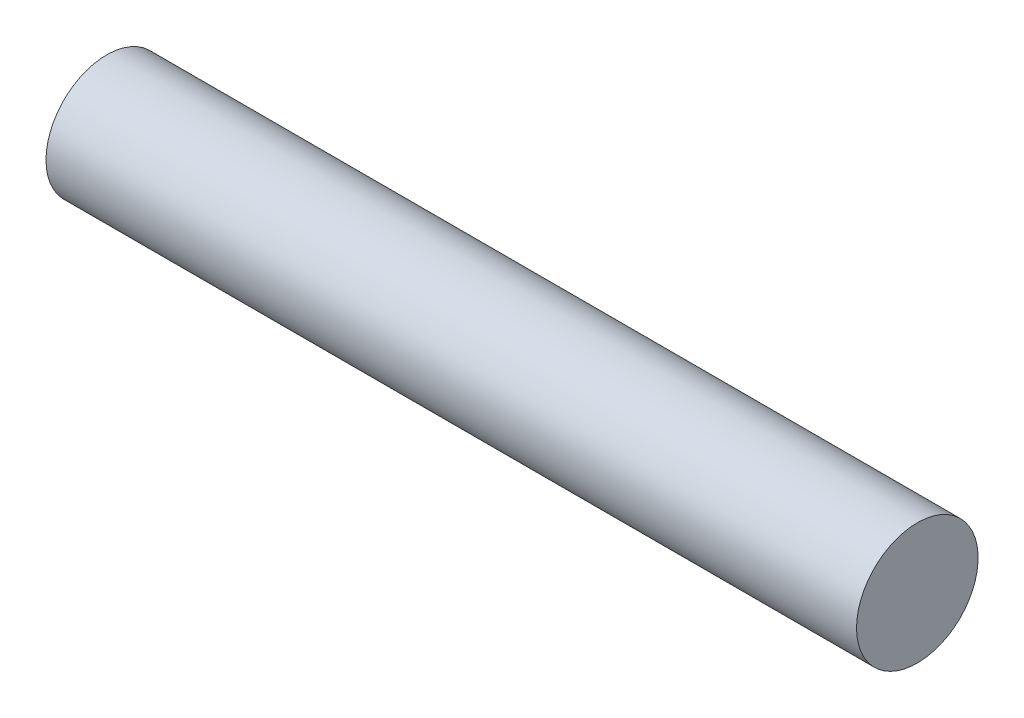
ISO-10303-21;
HEADER;
FILE_DESCRIPTION(('STEP AP214'),'2;1');
FILE_NAME('part.step','',(''),(''),'','','');
FILE_SCHEMA(('AUTOMOTIVE_DESIGN { 1 0 10303 214 1 1 1 1 }'));
ENDSEC;
DATA;
#1=APPLICATION_CONTEXT('core data for automotive mechanical design processes');
#2=APPLICATION_PROTOCOL_DEFINITION('international standard','automotive_design',2000,#1);
#3=PRODUCT_CONTEXT('',#1,'mechanical');
#4=PRODUCT('Part','Part','',(#3));
#5=PRODUCT_RELATED_PRODUCT_CATEGORY('part','',(#4));
#6=PRODUCT_DEFINITION_FORMATION('','',#4);
#7=PRODUCT_DEFINITION_CONTEXT('part definition',#1,'design');
#8=PRODUCT_DEFINITION('design','',#6,#7);
#9=PRODUCT_DEFINITION_SHAPE('','',#8);
#10=(LENGTH_UNIT() NAMED_UNIT(*) SI_UNIT(.MILLI.,.METRE.));
#11=(NAMED_UNIT(*) PLANE_ANGLE_UNIT() SI_UNIT($,.RADIAN.));
#12=(NAMED_UNIT(*) SI_UNIT($,.STERADIAN.) SOLID_ANGLE_UNIT());
#13=UNCERTAINTY_MEASURE_WITH_UNIT(LENGTH_MEASURE(1.E-05),#10,'distance_accuracy_value','');
#14=(GEOMETRIC_REPRESENTATION_CONTEXT(3) GLOBAL_UNCERTAINTY_ASSIGNED_CONTEXT((#13)) GLOBAL_UNIT_ASSIGNED_CONTEXT((#10,
#11,#12)) REPRESENTATION_CONTEXT('',''));
#15=CARTESIAN_POINT('',(0.,0.,0.));
#16=DIRECTION('',(0.,0.,1.));
#17=DIRECTION('',(1.,0.,0.));
#18=AXIS2_PLACEMENT_3D('',#15,#16,#17);
#19=CARTESIAN_POINT('',(651.894917120642,43.1757528863374,-362.871701067118));
#20=DIRECTION('',(-1.,0.,0.));
#21=DIRECTION('',(0.,0.,1.));
#22=AXIS2_PLACEMENT_3D('',#19,#20,#21);
#23=PLANE('',#22);
#24=CARTESIAN_POINT('',(651.894917120642,85.5761740117687,-295.009153101937));
#25=DIRECTION('',(-1.,0.,0.));
#26=DIRECTION('',(0.,0.,1.));
#27=AXIS2_PLACEMENT_3D('',#24,#25,#26);
#28=CIRCLE('',#27,1.5);
#29=CARTESIAN_POINT('',(651.894917120642,85.5761740117687,-293.509153101937));
#30=VERTEX_POINT('',#29);
#31=EDGE_CURVE('E18',#30,#30,#28,.F.);
#32=ORIENTED_EDGE('',*,*,#31,.F.);
#33=EDGE_LOOP('',(#32));
#34=FACE_BOUND('',#33,.T.);
#35=ADVANCED_FACE('F15',(#34),#23,.T.);
#36=CARTESIAN_POINT('',(671.894917120642,43.1757528863374,-362.871701067118));
#37=DIRECTION('',(-1.,0.,0.));
#38=DIRECTION('',(0.,0.,1.));
#39=AXIS2_PLACEMENT_3D('',#36,#37,#38);
#40=PLANE('',#39);
#41=CARTESIAN_POINT('',(671.894917120642,85.5761740117687,-295.009153101937));
#42=DIRECTION('',(-1.,0.,0.));
#43=DIRECTION('',(0.,0.,1.));
#44=AXIS2_PLACEMENT_3D('',#41,#42,#43);
#45=CIRCLE('',#44,1.5);
#46=CARTESIAN_POINT('',(671.894917120642,85.5761740117687,-293.509153101937));
#47=VERTEX_POINT('',#46);
#48=EDGE_CURVE('E10',#47,#47,#45,.T.);
#49=ORIENTED_EDGE('',*,*,#48,.F.);
#50=EDGE_LOOP('',(#49));
#51=FACE_BOUND('',#50,.T.);
#52=ADVANCED_FACE('F30',(#51),#40,.F.);
#53=CARTESIAN_POINT('',(661.894917120642,85.5761740117687,-295.009153101937));
#54=DIRECTION('',(-1.,0.,0.));
#55=DIRECTION('',(0.,0.,1.));
#56=AXIS2_PLACEMENT_3D('',#53,#54,#55);
#57=CYLINDRICAL_SURFACE('',#56,1.5);
#58=ORIENTED_EDGE('',*,*,#48,.T.);
#59=EDGE_LOOP('',(#58));
#60=FACE_BOUND('',#59,.T.);
#61=ORIENTED_EDGE('',*,*,#31,.T.);
#62=EDGE_LOOP('',(#61));
#63=FACE_BOUND('',#62,.T.);
#64=ADVANCED_FACE('F27',(#60,#63),#57,.T.);
#65=CLOSED_SHELL('',(#35,#52,#64));
#66=MANIFOLD_SOLID_BREP('B1',#65);
#67=ADVANCED_BREP_SHAPE_REPRESENTATION('',(#18,#66),#14);
#68=SHAPE_DEFINITION_REPRESENTATION(#9,#67);
ENDSEC;
END-ISO-10303-21;
